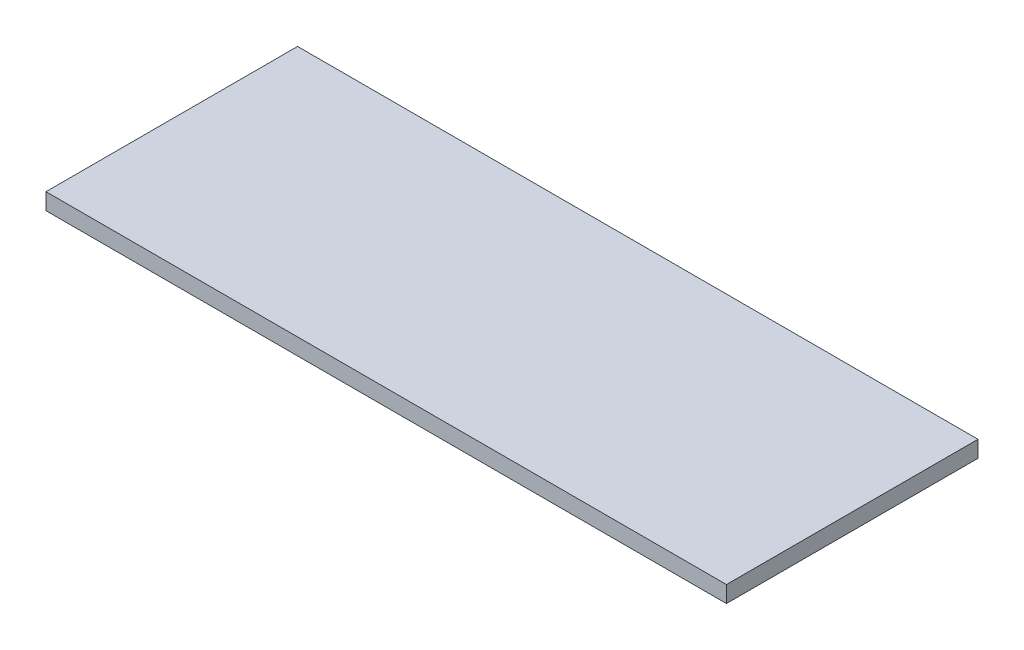
ISO-10303-21;
HEADER;
FILE_DESCRIPTION(('STEP AP214'),'2;1');
FILE_NAME('part.step','',(''),(''),'','','');
FILE_SCHEMA(('AUTOMOTIVE_DESIGN { 1 0 10303 214 1 1 1 1 }'));
ENDSEC;
DATA;
#1=APPLICATION_CONTEXT('core data for automotive mechanical design processes');
#2=APPLICATION_PROTOCOL_DEFINITION('international standard','automotive_design',2000,#1);
#3=PRODUCT_CONTEXT('',#1,'mechanical');
#4=PRODUCT('Part','Part','',(#3));
#5=PRODUCT_RELATED_PRODUCT_CATEGORY('part','',(#4));
#6=PRODUCT_DEFINITION_FORMATION('','',#4);
#7=PRODUCT_DEFINITION_CONTEXT('part definition',#1,'design');
#8=PRODUCT_DEFINITION('design','',#6,#7);
#9=PRODUCT_DEFINITION_SHAPE('','',#8);
#10=(LENGTH_UNIT() NAMED_UNIT(*) SI_UNIT(.MILLI.,.METRE.));
#11=(NAMED_UNIT(*) PLANE_ANGLE_UNIT() SI_UNIT($,.RADIAN.));
#12=(NAMED_UNIT(*) SI_UNIT($,.STERADIAN.) SOLID_ANGLE_UNIT());
#13=UNCERTAINTY_MEASURE_WITH_UNIT(LENGTH_MEASURE(1.E-05),#10,'distance_accuracy_value','');
#14=(GEOMETRIC_REPRESENTATION_CONTEXT(3) GLOBAL_UNCERTAINTY_ASSIGNED_CONTEXT((#13)) GLOBAL_UNIT_ASSIGNED_CONTEXT((#10,
#11,#12)) REPRESENTATION_CONTEXT('',''));
#15=CARTESIAN_POINT('',(0.,0.,0.));
#16=DIRECTION('',(0.,0.,1.));
#17=DIRECTION('',(1.,0.,0.));
#18=AXIS2_PLACEMENT_3D('',#15,#16,#17);
#19=CARTESIAN_POINT('',(82.5,4.,30.5));
#20=DIRECTION('',(-1.,0.,0.));
#21=DIRECTION('',(0.,0.,1.));
#22=AXIS2_PLACEMENT_3D('',#19,#20,#21);
#23=PLANE('',#22);
#24=DIRECTION('',(0.,0.,-1.));
#25=VECTOR('',#24,1.);
#26=CARTESIAN_POINT('',(82.5,0.,30.5));
#27=LINE('',#26,#25);
#28=CARTESIAN_POINT('',(82.5,0.,30.5));
#29=VERTEX_POINT('',#28);
#30=CARTESIAN_POINT('',(82.5,0.,-30.5));
#31=VERTEX_POINT('',#30);
#32=EDGE_CURVE('E97',#29,#31,#27,.T.);
#33=ORIENTED_EDGE('',*,*,#32,.T.);
#34=DIRECTION('',(0.,-1.,0.));
#35=VECTOR('',#34,1.);
#36=CARTESIAN_POINT('',(82.5,4.,-30.5));
#37=LINE('',#36,#35);
#38=CARTESIAN_POINT('',(82.5,4.,-30.5));
#39=VERTEX_POINT('',#38);
#40=EDGE_CURVE('E11',#39,#31,#37,.T.);
#41=ORIENTED_EDGE('',*,*,#40,.F.);
#42=DIRECTION('',(0.,0.,-1.));
#43=VECTOR('',#42,1.);
#44=CARTESIAN_POINT('',(82.5,4.,30.5));
#45=LINE('',#44,#43);
#46=CARTESIAN_POINT('',(82.5,4.,30.5));
#47=VERTEX_POINT('',#46);
#48=EDGE_CURVE('E85',#47,#39,#45,.T.);
#49=ORIENTED_EDGE('',*,*,#48,.F.);
#50=DIRECTION('',(0.,-1.,0.));
#51=VECTOR('',#50,1.);
#52=CARTESIAN_POINT('',(82.5,4.,30.5));
#53=LINE('',#52,#51);
#54=EDGE_CURVE('E93',#47,#29,#53,.T.);
#55=ORIENTED_EDGE('',*,*,#54,.T.);
#56=EDGE_LOOP('',(#33,#41,#49,#55));
#57=FACE_BOUND('',#56,.T.);
#58=ADVANCED_FACE('F34',(#57),#23,.F.);
#59=CARTESIAN_POINT('',(-82.5,4.,-30.5));
#60=DIRECTION('',(0.,0.,1.));
#61=DIRECTION('',(1.,0.,0.));
#62=AXIS2_PLACEMENT_3D('',#59,#60,#61);
#63=PLANE('',#62);
#64=DIRECTION('',(-1.,0.,0.));
#65=VECTOR('',#64,1.);
#66=CARTESIAN_POINT('',(-82.5,0.,-30.5));
#67=LINE('',#66,#65);
#68=CARTESIAN_POINT('',(-82.5,0.,-30.5));
#69=VERTEX_POINT('',#68);
#70=EDGE_CURVE('E89',#31,#69,#67,.T.);
#71=ORIENTED_EDGE('',*,*,#70,.T.);
#72=DIRECTION('',(0.,-1.,0.));
#73=VECTOR('',#72,1.);
#74=CARTESIAN_POINT('',(-82.5,4.,-30.5));
#75=LINE('',#74,#73);
#76=CARTESIAN_POINT('',(-82.5,4.,-30.5));
#77=VERTEX_POINT('',#76);
#78=EDGE_CURVE('E42',#77,#69,#75,.T.);
#79=ORIENTED_EDGE('',*,*,#78,.F.);
#80=DIRECTION('',(-1.,0.,0.));
#81=VECTOR('',#80,1.);
#82=CARTESIAN_POINT('',(-82.5,4.,-30.5));
#83=LINE('',#82,#81);
#84=EDGE_CURVE('E80',#39,#77,#83,.T.);
#85=ORIENTED_EDGE('',*,*,#84,.F.);
#86=ORIENTED_EDGE('',*,*,#40,.T.);
#87=EDGE_LOOP('',(#71,#79,#85,#86));
#88=FACE_BOUND('',#87,.T.);
#89=ADVANCED_FACE('F88',(#88),#63,.F.);
#90=CARTESIAN_POINT('',(-82.5,4.,30.5));
#91=DIRECTION('',(1.,0.,0.));
#92=DIRECTION('',(0.,0.,-1.));
#93=AXIS2_PLACEMENT_3D('',#90,#91,#92);
#94=PLANE('',#93);
#95=DIRECTION('',(0.,0.,1.));
#96=VECTOR('',#95,1.);
#97=CARTESIAN_POINT('',(-82.5,0.,30.5));
#98=LINE('',#97,#96);
#99=CARTESIAN_POINT('',(-82.5,0.,30.5));
#100=VERTEX_POINT('',#99);
#101=EDGE_CURVE('E67',#69,#100,#98,.T.);
#102=ORIENTED_EDGE('',*,*,#101,.T.);
#103=DIRECTION('',(0.,-1.,0.));
#104=VECTOR('',#103,1.);
#105=CARTESIAN_POINT('',(-82.5,4.,30.5));
#106=LINE('',#105,#104);
#107=CARTESIAN_POINT('',(-82.5,4.,30.5));
#108=VERTEX_POINT('',#107);
#109=EDGE_CURVE('E90',#108,#100,#106,.T.);
#110=ORIENTED_EDGE('',*,*,#109,.F.);
#111=DIRECTION('',(0.,0.,1.));
#112=VECTOR('',#111,1.);
#113=CARTESIAN_POINT('',(-82.5,4.,30.5));
#114=LINE('',#113,#112);
#115=EDGE_CURVE('E83',#77,#108,#114,.T.);
#116=ORIENTED_EDGE('',*,*,#115,.F.);
#117=ORIENTED_EDGE('',*,*,#78,.T.);
#118=EDGE_LOOP('',(#102,#110,#116,#117));
#119=FACE_BOUND('',#118,.T.);
#120=ADVANCED_FACE('F91',(#119),#94,.F.);
#121=CARTESIAN_POINT('',(-82.5,4.,30.5));
#122=DIRECTION('',(0.,0.,-1.));
#123=DIRECTION('',(-1.,0.,0.));
#124=AXIS2_PLACEMENT_3D('',#121,#122,#123);
#125=PLANE('',#124);
#126=DIRECTION('',(1.,0.,0.));
#127=VECTOR('',#126,1.);
#128=CARTESIAN_POINT('',(-82.5,0.,30.5));
#129=LINE('',#128,#127);
#130=EDGE_CURVE('E73',#100,#29,#129,.T.);
#131=ORIENTED_EDGE('',*,*,#130,.T.);
#132=ORIENTED_EDGE('',*,*,#54,.F.);
#133=DIRECTION('',(1.,0.,0.));
#134=VECTOR('',#133,1.);
#135=CARTESIAN_POINT('',(-82.5,4.,30.5));
#136=LINE('',#135,#134);
#137=EDGE_CURVE('E50',#108,#47,#136,.T.);
#138=ORIENTED_EDGE('',*,*,#137,.F.);
#139=ORIENTED_EDGE('',*,*,#109,.T.);
#140=EDGE_LOOP('',(#131,#132,#138,#139));
#141=FACE_BOUND('',#140,.T.);
#142=ADVANCED_FACE('F104',(#141),#125,.F.);
#143=CARTESIAN_POINT('',(0.,4.,0.));
#144=DIRECTION('',(0.,-1.,0.));
#145=DIRECTION('',(0.,0.,-1.));
#146=AXIS2_PLACEMENT_3D('',#143,#144,#145);
#147=PLANE('',#146);
#148=ORIENTED_EDGE('',*,*,#48,.T.);
#149=ORIENTED_EDGE('',*,*,#84,.T.);
#150=ORIENTED_EDGE('',*,*,#115,.T.);
#151=ORIENTED_EDGE('',*,*,#137,.T.);
#152=EDGE_LOOP('',(#148,#149,#150,#151));
#153=FACE_BOUND('',#152,.T.);
#154=ADVANCED_FACE('F81',(#153),#147,.F.);
#155=CARTESIAN_POINT('',(0.,0.,0.));
#156=DIRECTION('',(0.,-1.,0.));
#157=DIRECTION('',(0.,0.,-1.));
#158=AXIS2_PLACEMENT_3D('',#155,#156,#157);
#159=PLANE('',#158);
#160=ORIENTED_EDGE('',*,*,#32,.F.);
#161=ORIENTED_EDGE('',*,*,#130,.F.);
#162=ORIENTED_EDGE('',*,*,#101,.F.);
#163=ORIENTED_EDGE('',*,*,#70,.F.);
#164=EDGE_LOOP('',(#160,#161,#162,#163));
#165=FACE_BOUND('',#164,.T.);
#166=ADVANCED_FACE('F107',(#165),#159,.T.);
#167=CLOSED_SHELL('',(#58,#89,#120,#142,#154,#166));
#168=MANIFOLD_SOLID_BREP('B2',#167);
#169=ADVANCED_BREP_SHAPE_REPRESENTATION('',(#18,#168),#14);
#170=SHAPE_DEFINITION_REPRESENTATION(#9,#169);
ENDSEC;
END-ISO-10303-21;
